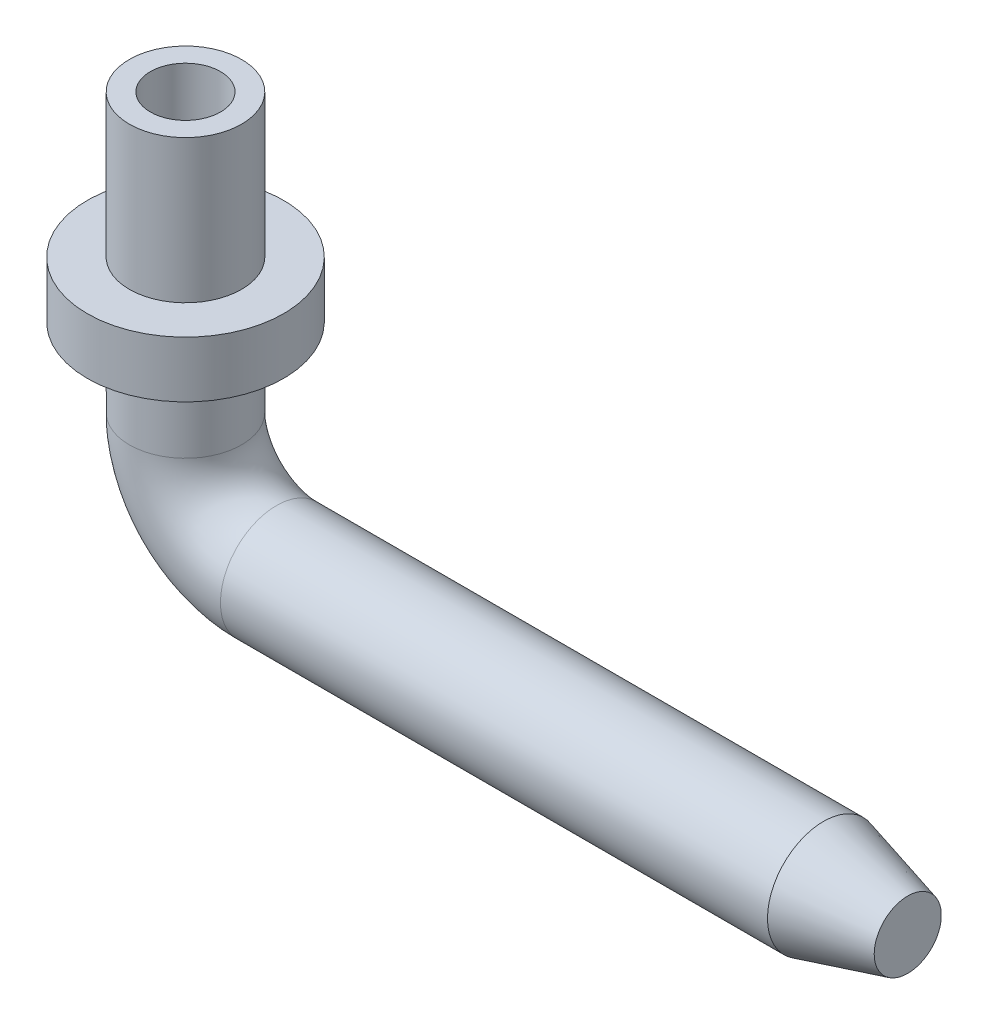
ISO-10303-21;
HEADER;
FILE_DESCRIPTION(('STEP AP214'),'2;1');
FILE_NAME('part.step','',(''),(''),'','','');
FILE_SCHEMA(('AUTOMOTIVE_DESIGN { 1 0 10303 214 1 1 1 1 }'));
ENDSEC;
DATA;
#1=APPLICATION_CONTEXT('core data for automotive mechanical design processes');
#2=APPLICATION_PROTOCOL_DEFINITION('international standard','automotive_design',2000,#1);
#3=PRODUCT_CONTEXT('',#1,'mechanical');
#4=PRODUCT('Part','Part','',(#3));
#5=PRODUCT_RELATED_PRODUCT_CATEGORY('part','',(#4));
#6=PRODUCT_DEFINITION_FORMATION('','',#4);
#7=PRODUCT_DEFINITION_CONTEXT('part definition',#1,'design');
#8=PRODUCT_DEFINITION('design','',#6,#7);
#9=PRODUCT_DEFINITION_SHAPE('','',#8);
#10=(LENGTH_UNIT() NAMED_UNIT(*) SI_UNIT(.MILLI.,.METRE.));
#11=(NAMED_UNIT(*) PLANE_ANGLE_UNIT() SI_UNIT($,.RADIAN.));
#12=(NAMED_UNIT(*) SI_UNIT($,.STERADIAN.) SOLID_ANGLE_UNIT());
#13=UNCERTAINTY_MEASURE_WITH_UNIT(LENGTH_MEASURE(1.E-05),#10,'distance_accuracy_value','');
#14=(GEOMETRIC_REPRESENTATION_CONTEXT(3) GLOBAL_UNCERTAINTY_ASSIGNED_CONTEXT((#13)) GLOBAL_UNIT_ASSIGNED_CONTEXT((#10,
#11,#12)) REPRESENTATION_CONTEXT('',''));
#15=CARTESIAN_POINT('',(0.,0.,0.));
#16=DIRECTION('',(0.,0.,1.));
#17=DIRECTION('',(1.,0.,0.));
#18=AXIS2_PLACEMENT_3D('',#15,#16,#17);
#19=CARTESIAN_POINT('',(-6.53967725312495,3.33927725312497,0.));
#20=DIRECTION('',(0.,1.,0.));
#21=DIRECTION('',(0.,0.,1.));
#22=AXIS2_PLACEMENT_3D('',#19,#20,#21);
#23=CYLINDRICAL_SURFACE('',#22,0.3175);
#24=CARTESIAN_POINT('',(-6.53967725312495,3.33927725312497,0.));
#25=DIRECTION('',(0.,1.,0.));
#26=DIRECTION('',(0.,0.,1.));
#27=AXIS2_PLACEMENT_3D('',#24,#25,#26);
#28=CIRCLE('',#27,0.3175);
#29=CARTESIAN_POINT('',(-6.53967725312495,3.33927725312497,0.317500000000023));
#30=VERTEX_POINT('',#29);
#31=EDGE_CURVE('E169',#30,#30,#28,.T.);
#32=ORIENTED_EDGE('',*,*,#31,.T.);
#33=EDGE_LOOP('',(#32));
#34=FACE_BOUND('',#33,.T.);
#35=CARTESIAN_POINT('',(-6.53967725312496,2.32327725312497,0.));
#36=DIRECTION('',(0.,1.,0.));
#37=DIRECTION('',(0.,0.,1.));
#38=AXIS2_PLACEMENT_3D('',#35,#36,#37);
#39=CIRCLE('',#38,0.3175);
#40=CARTESIAN_POINT('',(-6.53967725312496,2.32327725312496,0.317500000000016));
#41=VERTEX_POINT('',#40);
#42=EDGE_CURVE('E150',#41,#41,#39,.T.);
#43=ORIENTED_EDGE('',*,*,#42,.F.);
#44=EDGE_LOOP('',(#43));
#45=FACE_BOUND('',#44,.T.);
#46=ADVANCED_FACE('F76',(#34,#45),#23,.F.);
#47=CARTESIAN_POINT('',(-6.53967725312496,2.32327725312497,0.));
#48=DIRECTION('',(0.,1.,0.));
#49=DIRECTION('',(0.,0.,1.));
#50=AXIS2_PLACEMENT_3D('',#47,#48,#49);
#51=CONICAL_SURFACE('',#50,0.3175,1.02974425867667);
#52=ORIENTED_EDGE('',*,*,#42,.T.);
#53=EDGE_LOOP('',(#52));
#54=FACE_BOUND('',#53,.T.);
#55=CARTESIAN_POINT('',(-6.53967725312496,2.13250400658372,0.));
#56=VERTEX_POINT('',#55);
#57=VERTEX_LOOP('',#56);
#58=FACE_BOUND('',#57,.T.);
#59=ADVANCED_FACE('F88',(#54,#58),#51,.F.);
#60=CARTESIAN_POINT('',(-6.53967725312495,3.33927725312497,0.));
#61=DIRECTION('',(0.,1.,0.));
#62=DIRECTION('',(0.,0.,1.));
#63=AXIS2_PLACEMENT_3D('',#60,#61,#62);
#64=CYLINDRICAL_SURFACE('',#63,0.507999999999979);
#65=CARTESIAN_POINT('',(-6.53967725312495,3.33927725312497,0.));
#66=DIRECTION('',(0.,1.,0.));
#67=DIRECTION('',(0.,0.,1.));
#68=AXIS2_PLACEMENT_3D('',#65,#66,#67);
#69=CIRCLE('',#68,0.507999999999979);
#70=CARTESIAN_POINT('',(-6.53967725312495,3.33927725312497,0.508000000000003));
#71=VERTEX_POINT('',#70);
#72=EDGE_CURVE('E143',#71,#71,#69,.T.);
#73=ORIENTED_EDGE('',*,*,#72,.F.);
#74=EDGE_LOOP('',(#73));
#75=FACE_BOUND('',#74,.T.);
#76=CARTESIAN_POINT('',(-6.53967725312496,2.04387725312497,0.));
#77=DIRECTION('',(0.,1.,0.));
#78=DIRECTION('',(0.,0.,1.));
#79=AXIS2_PLACEMENT_3D('',#76,#77,#78);
#80=CIRCLE('',#79,0.507999999999979);
#81=CARTESIAN_POINT('',(-6.53967725312496,2.04387725312497,0.507999999999994));
#82=VERTEX_POINT('',#81);
#83=EDGE_CURVE('E13',#82,#82,#80,.T.);
#84=ORIENTED_EDGE('',*,*,#83,.T.);
#85=EDGE_LOOP('',(#84));
#86=FACE_BOUND('',#85,.T.);
#87=ADVANCED_FACE('F90',(#75,#86),#64,.T.);
#88=CARTESIAN_POINT('',(-6.53967725312495,3.33927725312497,0.));
#89=DIRECTION('',(0.,1.,0.));
#90=DIRECTION('',(0.,0.,1.));
#91=AXIS2_PLACEMENT_3D('',#88,#89,#90);
#92=CYLINDRICAL_SURFACE('',#91,0.889000000000001);
#93=CARTESIAN_POINT('',(-6.53967725312496,2.04387725312497,0.));
#94=DIRECTION('',(0.,1.,0.));
#95=DIRECTION('',(0.,0.,1.));
#96=AXIS2_PLACEMENT_3D('',#93,#94,#95);
#97=CIRCLE('',#96,0.889000000000001);
#98=CARTESIAN_POINT('',(-6.53967725312495,2.04387725312496,0.889000000000015));
#99=VERTEX_POINT('',#98);
#100=EDGE_CURVE('E144',#99,#99,#97,.T.);
#101=ORIENTED_EDGE('',*,*,#100,.F.);
#102=EDGE_LOOP('',(#101));
#103=FACE_BOUND('',#102,.T.);
#104=CARTESIAN_POINT('',(-6.53967725312496,1.53587725312498,0.));
#105=DIRECTION('',(0.,1.,0.));
#106=DIRECTION('',(0.,0.,1.));
#107=AXIS2_PLACEMENT_3D('',#104,#105,#106);
#108=CIRCLE('',#107,0.889000000000001);
#109=CARTESIAN_POINT('',(-6.53967725312496,1.53587725312497,0.889000000000012));
#110=VERTEX_POINT('',#109);
#111=EDGE_CURVE('E84',#110,#110,#108,.T.);
#112=ORIENTED_EDGE('',*,*,#111,.T.);
#113=EDGE_LOOP('',(#112));
#114=FACE_BOUND('',#113,.T.);
#115=ADVANCED_FACE('F97',(#103,#114),#92,.T.);
#116=CARTESIAN_POINT('',(-9.52499999999999,0.,0.));
#117=DIRECTION('',(-1.,0.,0.));
#118=DIRECTION('',(0.,0.,1.));
#119=AXIS2_PLACEMENT_3D('',#116,#117,#118);
#120=CYLINDRICAL_SURFACE('',#119,0.50799999999998);
#121=CARTESIAN_POINT('',(-5.715,0.,0.));
#122=DIRECTION('',(-1.,0.,0.));
#123=DIRECTION('',(0.,-1.,0.));
#124=AXIS2_PLACEMENT_3D('',#121,#122,#123);
#125=CIRCLE('',#124,0.50799999999998);
#126=CARTESIAN_POINT('',(-5.71500000000001,-0.50799999999998,0.));
#127=VERTEX_POINT('',#126);
#128=EDGE_CURVE('E187',#127,#127,#125,.T.);
#129=ORIENTED_EDGE('',*,*,#128,.F.);
#130=EDGE_LOOP('',(#129));
#131=FACE_BOUND('',#130,.T.);
#132=CARTESIAN_POINT('',(-0.761999999999985,0.,0.));
#133=DIRECTION('',(-1.,0.,0.));
#134=DIRECTION('',(0.,0.,1.));
#135=AXIS2_PLACEMENT_3D('',#132,#133,#134);
#136=CIRCLE('',#135,0.50799999999998);
#137=CARTESIAN_POINT('',(-0.761999999999985,0.,0.50799999999998));
#138=VERTEX_POINT('',#137);
#139=EDGE_CURVE('E159',#138,#138,#136,.T.);
#140=ORIENTED_EDGE('',*,*,#139,.T.);
#141=EDGE_LOOP('',(#140));
#142=FACE_BOUND('',#141,.T.);
#143=ADVANCED_FACE('F106',(#131,#142),#120,.T.);
#144=CARTESIAN_POINT('',(0.,0.,0.));
#145=DIRECTION('',(-1.,0.,0.));
#146=DIRECTION('',(0.,0.,1.));
#147=AXIS2_PLACEMENT_3D('',#144,#145,#146);
#148=CONICAL_SURFACE('',#147,0.303822715367468,0.26179938779915);
#149=ORIENTED_EDGE('',*,*,#139,.F.);
#150=EDGE_LOOP('',(#149));
#151=FACE_BOUND('',#150,.T.);
#152=CARTESIAN_POINT('',(0.,0.,0.));
#153=DIRECTION('',(-1.,0.,0.));
#154=DIRECTION('',(0.,0.,1.));
#155=AXIS2_PLACEMENT_3D('',#152,#153,#154);
#156=CIRCLE('',#155,0.303822715367468);
#157=CARTESIAN_POINT('',(0.,0.,0.303822715367468));
#158=VERTEX_POINT('',#157);
#159=EDGE_CURVE('E183',#158,#158,#156,.T.);
#160=ORIENTED_EDGE('',*,*,#159,.T.);
#161=EDGE_LOOP('',(#160));
#162=FACE_BOUND('',#161,.T.);
#163=ADVANCED_FACE('F110',(#151,#162),#148,.T.);
#164=CARTESIAN_POINT('',(-5.71499999999999,0.824677253124961,0.));
#165=DIRECTION('',(0.,0.,-1.));
#166=DIRECTION('',(0.,-1.,0.));
#167=AXIS2_PLACEMENT_3D('',#164,#165,#166);
#168=TOROIDAL_SURFACE('',#167,0.824677253125001,0.50799999999998);
#169=CARTESIAN_POINT('',(-6.53967725312497,0.824677253124973,0.));
#170=DIRECTION('',(0.,1.,0.));
#171=DIRECTION('',(-1.,0.,0.));
#172=AXIS2_PLACEMENT_3D('',#169,#170,#171);
#173=CIRCLE('',#172,0.50799999999998);
#174=CARTESIAN_POINT('',(-7.04767725312495,0.82467725312498,0.));
#175=VERTEX_POINT('',#174);
#176=EDGE_CURVE('E147',#175,#175,#173,.T.);
#177=ORIENTED_EDGE('',*,*,#176,.F.);
#178=EDGE_LOOP('',(#177));
#179=FACE_BOUND('',#178,.T.);
#180=ORIENTED_EDGE('',*,*,#128,.T.);
#181=EDGE_LOOP('',(#180));
#182=FACE_BOUND('',#181,.T.);
#183=ADVANCED_FACE('F114',(#179,#182),#168,.T.);
#184=CARTESIAN_POINT('',(-6.53967725312495,3.33927725312497,0.));
#185=DIRECTION('',(0.,1.,0.));
#186=DIRECTION('',(0.,0.,1.));
#187=AXIS2_PLACEMENT_3D('',#184,#185,#186);
#188=CYLINDRICAL_SURFACE('',#187,0.50799999999998);
#189=CARTESIAN_POINT('',(-6.53967725312496,1.53587725312498,0.));
#190=DIRECTION('',(0.,1.,0.));
#191=DIRECTION('',(0.,0.,1.));
#192=AXIS2_PLACEMENT_3D('',#189,#190,#191);
#193=CIRCLE('',#192,0.50799999999998);
#194=CARTESIAN_POINT('',(-6.53967725312496,1.53587725312497,0.50799999999999));
#195=VERTEX_POINT('',#194);
#196=EDGE_CURVE('E142',#195,#195,#193,.T.);
#197=ORIENTED_EDGE('',*,*,#196,.F.);
#198=EDGE_LOOP('',(#197));
#199=FACE_BOUND('',#198,.T.);
#200=ORIENTED_EDGE('',*,*,#176,.T.);
#201=EDGE_LOOP('',(#200));
#202=FACE_BOUND('',#201,.T.);
#203=ADVANCED_FACE('F118',(#199,#202),#188,.T.);
#204=CARTESIAN_POINT('',(-6.03167725312497,3.33927725312497,0.));
#205=DIRECTION('',(0.,-1.,0.));
#206=DIRECTION('',(0.,0.,-1.));
#207=AXIS2_PLACEMENT_3D('',#204,#205,#206);
#208=PLANE('',#207);
#209=ORIENTED_EDGE('',*,*,#31,.F.);
#210=EDGE_LOOP('',(#209));
#211=FACE_BOUND('',#210,.T.);
#212=ORIENTED_EDGE('',*,*,#72,.T.);
#213=EDGE_LOOP('',(#212));
#214=FACE_BOUND('',#213,.T.);
#215=ADVANCED_FACE('F122',(#211,#214),#208,.F.);
#216=CARTESIAN_POINT('',(0.,0.,0.));
#217=DIRECTION('',(-1.,0.,0.));
#218=DIRECTION('',(0.,0.,1.));
#219=AXIS2_PLACEMENT_3D('',#216,#217,#218);
#220=PLANE('',#219);
#221=ORIENTED_EDGE('',*,*,#159,.F.);
#222=EDGE_LOOP('',(#221));
#223=FACE_BOUND('',#222,.T.);
#224=ADVANCED_FACE('F126',(#223),#220,.F.);
#225=CARTESIAN_POINT('',(-5.65067725312496,1.53587725312497,0.));
#226=DIRECTION('',(0.,1.,0.));
#227=DIRECTION('',(0.,0.,1.));
#228=AXIS2_PLACEMENT_3D('',#225,#226,#227);
#229=PLANE('',#228);
#230=ORIENTED_EDGE('',*,*,#111,.F.);
#231=EDGE_LOOP('',(#230));
#232=FACE_BOUND('',#231,.T.);
#233=ORIENTED_EDGE('',*,*,#196,.T.);
#234=EDGE_LOOP('',(#233));
#235=FACE_BOUND('',#234,.T.);
#236=ADVANCED_FACE('F129',(#232,#235),#229,.F.);
#237=CARTESIAN_POINT('',(-6.03167725312498,2.04387725312497,0.));
#238=DIRECTION('',(0.,-1.,0.));
#239=DIRECTION('',(0.,0.,-1.));
#240=AXIS2_PLACEMENT_3D('',#237,#238,#239);
#241=PLANE('',#240);
#242=ORIENTED_EDGE('',*,*,#83,.F.);
#243=EDGE_LOOP('',(#242));
#244=FACE_BOUND('',#243,.T.);
#245=ORIENTED_EDGE('',*,*,#100,.T.);
#246=EDGE_LOOP('',(#245));
#247=FACE_BOUND('',#246,.T.);
#248=ADVANCED_FACE('F78',(#244,#247),#241,.F.);
#249=CLOSED_SHELL('',(#46,#59,#87,#115,#143,#163,#183,#203,#215,#224,#236,#248));
#250=MANIFOLD_SOLID_BREP('B2',#249);
#251=ADVANCED_BREP_SHAPE_REPRESENTATION('',(#18,#250),#14);
#252=SHAPE_DEFINITION_REPRESENTATION(#9,#251);
ENDSEC;
END-ISO-10303-21;
